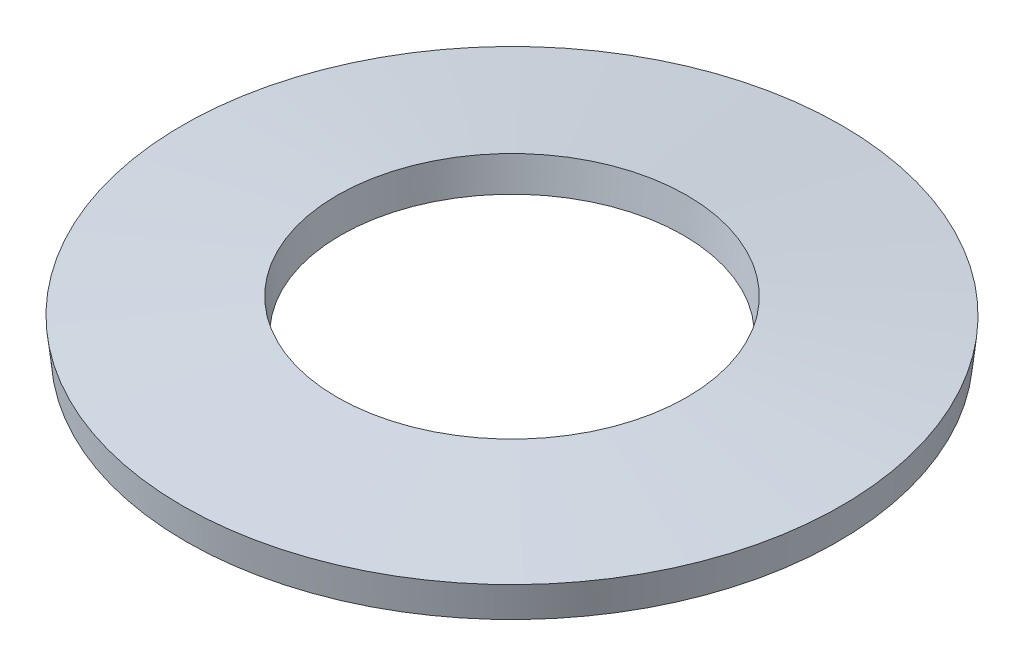
ISO-10303-21;
HEADER;
FILE_DESCRIPTION(('STEP AP214'),'2;1');
FILE_NAME('part.step','',(''),(''),'','','');
FILE_SCHEMA(('AUTOMOTIVE_DESIGN { 1 0 10303 214 1 1 1 1 }'));
ENDSEC;
DATA;
#1=APPLICATION_CONTEXT('core data for automotive mechanical design processes');
#2=APPLICATION_PROTOCOL_DEFINITION('international standard','automotive_design',2000,#1);
#3=PRODUCT_CONTEXT('',#1,'mechanical');
#4=PRODUCT('Part','Part','',(#3));
#5=PRODUCT_RELATED_PRODUCT_CATEGORY('part','',(#4));
#6=PRODUCT_DEFINITION_FORMATION('','',#4);
#7=PRODUCT_DEFINITION_CONTEXT('part definition',#1,'design');
#8=PRODUCT_DEFINITION('design','',#6,#7);
#9=PRODUCT_DEFINITION_SHAPE('','',#8);
#10=(LENGTH_UNIT() NAMED_UNIT(*) SI_UNIT(.MILLI.,.METRE.));
#11=(NAMED_UNIT(*) PLANE_ANGLE_UNIT() SI_UNIT($,.RADIAN.));
#12=(NAMED_UNIT(*) SI_UNIT($,.STERADIAN.) SOLID_ANGLE_UNIT());
#13=UNCERTAINTY_MEASURE_WITH_UNIT(LENGTH_MEASURE(1.E-05),#10,'distance_accuracy_value','');
#14=(GEOMETRIC_REPRESENTATION_CONTEXT(3) GLOBAL_UNCERTAINTY_ASSIGNED_CONTEXT((#13)) GLOBAL_UNIT_ASSIGNED_CONTEXT((#10,
#11,#12)) REPRESENTATION_CONTEXT('',''));
#15=CARTESIAN_POINT('',(0.,0.,0.));
#16=DIRECTION('',(0.,0.,1.));
#17=DIRECTION('',(1.,0.,0.));
#18=AXIS2_PLACEMENT_3D('',#15,#16,#17);
#19=CARTESIAN_POINT('',(0.,0.,0.));
#20=DIRECTION('',(0.,-1.,0.));
#21=DIRECTION('',(0.,0.,-1.));
#22=AXIS2_PLACEMENT_3D('',#19,#20,#21);
#23=CONICAL_SURFACE('',#22,4.94642427804592,1.46343877434757);
#24=CARTESIAN_POINT('',(0.,0.252878644573684,0.));
#25=DIRECTION('',(0.,1.,0.));
#26=DIRECTION('',(0.,0.,1.));
#27=AXIS2_PLACEMENT_3D('',#24,#25,#26);
#28=CIRCLE('',#27,2.60000000000815);
#29=CARTESIAN_POINT('',(0.,0.252878644573684,2.60000000000815));
#30=VERTEX_POINT('',#29);
#31=EDGE_CURVE('E18',#30,#30,#28,.T.);
#32=ORIENTED_EDGE('',*,*,#31,.T.);
#33=EDGE_LOOP('',(#32));
#34=FACE_BOUND('',#33,.T.);
#35=CARTESIAN_POINT('',(0.,0.,0.));
#36=DIRECTION('',(0.,1.,0.));
#37=DIRECTION('',(0.,0.,1.));
#38=AXIS2_PLACEMENT_3D('',#35,#36,#37);
#39=CIRCLE('',#38,4.94642427810987);
#40=CARTESIAN_POINT('',(0.,0.,4.94642427810987));
#41=VERTEX_POINT('',#40);
#42=EDGE_CURVE('E27',#41,#41,#39,.T.);
#43=ORIENTED_EDGE('',*,*,#42,.F.);
#44=EDGE_LOOP('',(#43));
#45=FACE_BOUND('',#44,.T.);
#46=ADVANCED_FACE('F15',(#34,#45),#23,.F.);
#47=CARTESIAN_POINT('',(0.,0.749999999754891,0.));
#48=DIRECTION('',(0.,1.,0.));
#49=DIRECTION('',(-1.,0.,0.));
#50=AXIS2_PLACEMENT_3D('',#47,#48,#49);
#51=CONICAL_SURFACE('',#50,2.65357572186531,0.107357552452681);
#52=ORIENTED_EDGE('',*,*,#31,.F.);
#53=EDGE_LOOP('',(#52));
#54=FACE_BOUND('',#53,.T.);
#55=CARTESIAN_POINT('',(0.,0.750000000003581,0.));
#56=DIRECTION('',(0.,-1.,0.));
#57=DIRECTION('',(0.,0.,-1.));
#58=AXIS2_PLACEMENT_3D('',#55,#56,#57);
#59=CIRCLE('',#58,2.65357572186531);
#60=CARTESIAN_POINT('',(0.,0.750000000003581,-2.65357572186531));
#61=VERTEX_POINT('',#60);
#62=EDGE_CURVE('E22',#61,#61,#59,.T.);
#63=ORIENTED_EDGE('',*,*,#62,.F.);
#64=EDGE_LOOP('',(#63));
#65=FACE_BOUND('',#64,.T.);
#66=ADVANCED_FACE('F37',(#54,#65),#51,.F.);
#67=CARTESIAN_POINT('',(0.,0.49712135523805,0.));
#68=DIRECTION('',(0.,1.,0.));
#69=DIRECTION('',(0.,0.,1.));
#70=AXIS2_PLACEMENT_3D('',#67,#68,#69);
#71=CONICAL_SURFACE('',#70,4.99999999998124,0.107357552450733);
#72=CARTESIAN_POINT('',(0.,0.497121355437002,0.));
#73=DIRECTION('',(0.,-1.,0.));
#74=DIRECTION('',(0.,0.,-1.));
#75=AXIS2_PLACEMENT_3D('',#72,#73,#74);
#76=CIRCLE('',#75,4.99999999999545);
#77=CARTESIAN_POINT('',(0.,0.497121355437002,-4.99999999999545));
#78=VERTEX_POINT('',#77);
#79=EDGE_CURVE('E10',#78,#78,#76,.F.);
#80=ORIENTED_EDGE('',*,*,#79,.F.);
#81=EDGE_LOOP('',(#80));
#82=FACE_BOUND('',#81,.T.);
#83=ORIENTED_EDGE('',*,*,#42,.T.);
#84=EDGE_LOOP('',(#83));
#85=FACE_BOUND('',#84,.T.);
#86=ADVANCED_FACE('F40',(#82,#85),#71,.T.);
#87=CARTESIAN_POINT('',(0.,0.497121355451213,0.));
#88=DIRECTION('',(0.,-1.,0.));
#89=DIRECTION('',(0.,0.,-1.));
#90=AXIS2_PLACEMENT_3D('',#87,#88,#89);
#91=CONICAL_SURFACE('',#90,4.99999999982492,1.46343877434757);
#92=ORIENTED_EDGE('',*,*,#79,.T.);
#93=EDGE_LOOP('',(#92));
#94=FACE_BOUND('',#93,.T.);
#95=ORIENTED_EDGE('',*,*,#62,.T.);
#96=EDGE_LOOP('',(#95));
#97=FACE_BOUND('',#96,.T.);
#98=ADVANCED_FACE('F43',(#94,#97),#91,.T.);
#99=CLOSED_SHELL('',(#46,#66,#86,#98));
#100=MANIFOLD_SOLID_BREP('B1',#99);
#101=ADVANCED_BREP_SHAPE_REPRESENTATION('',(#18,#100),#14);
#102=SHAPE_DEFINITION_REPRESENTATION(#9,#101);
ENDSEC;
END-ISO-10303-21;
